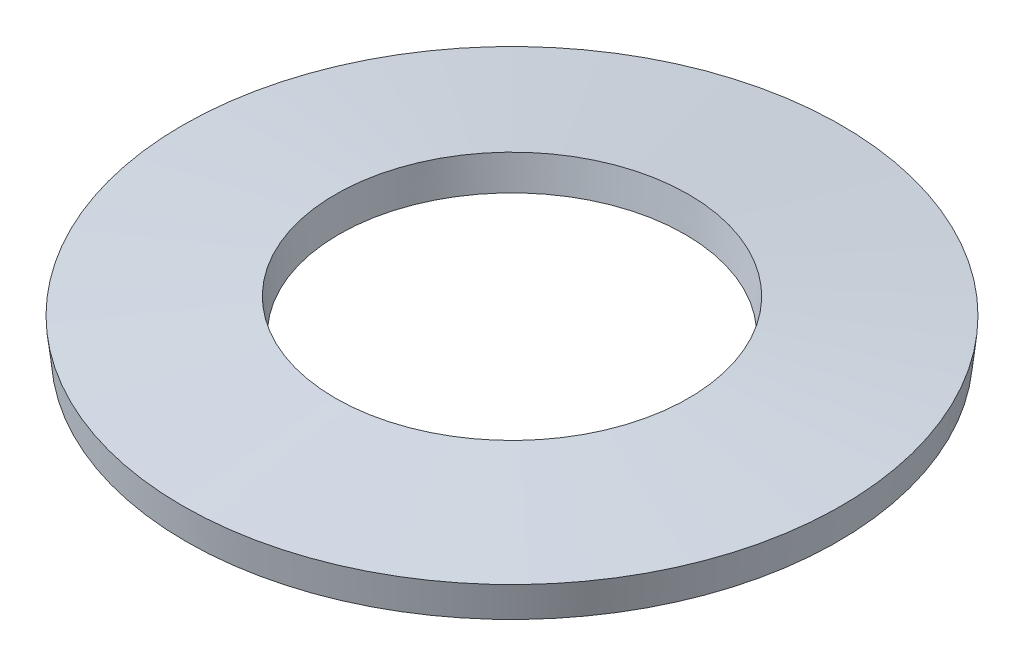
ISO-10303-21;
HEADER;
FILE_DESCRIPTION(('STEP AP214'),'2;1');
FILE_NAME('part.step','',(''),(''),'','','');
FILE_SCHEMA(('AUTOMOTIVE_DESIGN { 1 0 10303 214 1 1 1 1 }'));
ENDSEC;
DATA;
#1=APPLICATION_CONTEXT('core data for automotive mechanical design processes');
#2=APPLICATION_PROTOCOL_DEFINITION('international standard','automotive_design',2000,#1);
#3=PRODUCT_CONTEXT('',#1,'mechanical');
#4=PRODUCT('Part','Part','',(#3));
#5=PRODUCT_RELATED_PRODUCT_CATEGORY('part','',(#4));
#6=PRODUCT_DEFINITION_FORMATION('','',#4);
#7=PRODUCT_DEFINITION_CONTEXT('part definition',#1,'design');
#8=PRODUCT_DEFINITION('design','',#6,#7);
#9=PRODUCT_DEFINITION_SHAPE('','',#8);
#10=(LENGTH_UNIT() NAMED_UNIT(*) SI_UNIT(.MILLI.,.METRE.));
#11=(NAMED_UNIT(*) PLANE_ANGLE_UNIT() SI_UNIT($,.RADIAN.));
#12=(NAMED_UNIT(*) SI_UNIT($,.STERADIAN.) SOLID_ANGLE_UNIT());
#13=UNCERTAINTY_MEASURE_WITH_UNIT(LENGTH_MEASURE(1.E-05),#10,'distance_accuracy_value','');
#14=(GEOMETRIC_REPRESENTATION_CONTEXT(3) GLOBAL_UNCERTAINTY_ASSIGNED_CONTEXT((#13)) GLOBAL_UNIT_ASSIGNED_CONTEXT((#10,
#11,#12)) REPRESENTATION_CONTEXT('',''));
#15=CARTESIAN_POINT('',(0.,0.,0.));
#16=DIRECTION('',(0.,0.,1.));
#17=DIRECTION('',(1.,0.,0.));
#18=AXIS2_PLACEMENT_3D('',#15,#16,#17);
#19=CARTESIAN_POINT('',(0.,-0.0202354688,0.));
#20=DIRECTION('',(0.,-1.,0.));
#21=DIRECTION('',(0.,0.,-1.));
#22=AXIS2_PLACEMENT_3D('',#19,#20,#21);
#23=CONICAL_SURFACE('',#22,4.1423273516,1.46223631090766);
#24=CARTESIAN_POINT('',(0.,0.2023547388,0.));
#25=DIRECTION('',(0.,1.,0.));
#26=DIRECTION('',(0.,0.,1.));
#27=AXIS2_PLACEMENT_3D('',#24,#25,#26);
#28=CIRCLE('',#27,2.099999991);
#29=CARTESIAN_POINT('',(0.,0.2023547388,2.099999991));
#30=VERTEX_POINT('',#29);
#31=EDGE_CURVE('E18',#30,#30,#28,.T.);
#32=ORIENTED_EDGE('',*,*,#31,.T.);
#33=EDGE_LOOP('',(#32));
#34=FACE_BOUND('',#33,.T.);
#35=CARTESIAN_POINT('',(0.,0.,0.));
#36=DIRECTION('',(0.,1.,0.));
#37=DIRECTION('',(0.,0.,1.));
#38=AXIS2_PLACEMENT_3D('',#35,#36,#37);
#39=CIRCLE('',#38,3.9566612256);
#40=CARTESIAN_POINT('',(0.,0.,3.9566612256));
#41=VERTEX_POINT('',#40);
#42=EDGE_CURVE('E27',#41,#41,#39,.T.);
#43=ORIENTED_EDGE('',*,*,#42,.F.);
#44=EDGE_LOOP('',(#43));
#45=FACE_BOUND('',#44,.T.);
#46=ADVANCED_FACE('F14',(#34,#45),#23,.F.);
#47=CARTESIAN_POINT('',(0.,0.639764532,0.));
#48=DIRECTION('',(0.,1.,0.));
#49=DIRECTION('',(0.,0.,1.));
#50=AXIS2_PLACEMENT_3D('',#47,#48,#49);
#51=CONICAL_SURFACE('',#50,2.1476726414,0.108560039770957);
#52=ORIENTED_EDGE('',*,*,#31,.F.);
#53=EDGE_LOOP('',(#52));
#54=FACE_BOUND('',#53,.T.);
#55=CARTESIAN_POINT('',(0.,0.5999999938,0.));
#56=DIRECTION('',(0.,-1.,0.));
#57=DIRECTION('',(0.,0.,-1.));
#58=AXIS2_PLACEMENT_3D('',#55,#56,#57);
#59=CIRCLE('',#58,2.1433387664);
#60=CARTESIAN_POINT('',(0.,0.5999999938,-2.1433387664));
#61=VERTEX_POINT('',#60);
#62=EDGE_CURVE('E22',#61,#61,#59,.T.);
#63=ORIENTED_EDGE('',*,*,#62,.F.);
#64=EDGE_LOOP('',(#63));
#65=FACE_BOUND('',#64,.T.);
#66=ADVANCED_FACE('F37',(#54,#65),#51,.F.);
#67=CARTESIAN_POINT('',(0.,0.4374097932,0.));
#68=DIRECTION('',(0.,1.,0.));
#69=DIRECTION('',(0.,0.,1.));
#70=AXIS2_PLACEMENT_3D('',#67,#68,#69);
#71=CONICAL_SURFACE('',#70,4.004333876,0.108560039770955);
#72=CARTESIAN_POINT('',(0.,0.397645259638417,0.));
#73=DIRECTION('',(0.,1.,0.));
#74=DIRECTION('',(-1.,0.,0.));
#75=AXIS2_PLACEMENT_3D('',#72,#73,#74);
#76=CIRCLE('',#75,4.00000000312343);
#77=CARTESIAN_POINT('',(-4.00000000312343,0.397645259638417,0.));
#78=VERTEX_POINT('',#77);
#79=EDGE_CURVE('E10',#78,#78,#76,.T.);
#80=ORIENTED_EDGE('',*,*,#79,.F.);
#81=EDGE_LOOP('',(#80));
#82=FACE_BOUND('',#81,.T.);
#83=ORIENTED_EDGE('',*,*,#42,.T.);
#84=EDGE_LOOP('',(#83));
#85=FACE_BOUND('',#84,.T.);
#86=ADVANCED_FACE('F40',(#82,#85),#71,.T.);
#87=CARTESIAN_POINT('',(0.,0.3774097862,0.));
#88=DIRECTION('',(0.,-1.,0.));
#89=DIRECTION('',(1.,0.,0.));
#90=AXIS2_PLACEMENT_3D('',#87,#88,#89);
#91=CONICAL_SURFACE('',#90,4.185666127,1.46223631090766);
#92=ORIENTED_EDGE('',*,*,#79,.T.);
#93=EDGE_LOOP('',(#92));
#94=FACE_BOUND('',#93,.T.);
#95=ORIENTED_EDGE('',*,*,#62,.T.);
#96=EDGE_LOOP('',(#95));
#97=FACE_BOUND('',#96,.T.);
#98=ADVANCED_FACE('F16',(#94,#97),#91,.T.);
#99=CLOSED_SHELL('',(#46,#66,#86,#98));
#100=MANIFOLD_SOLID_BREP('B1',#99);
#101=ADVANCED_BREP_SHAPE_REPRESENTATION('',(#18,#100),#14);
#102=SHAPE_DEFINITION_REPRESENTATION(#9,#101);
ENDSEC;
END-ISO-10303-21;
